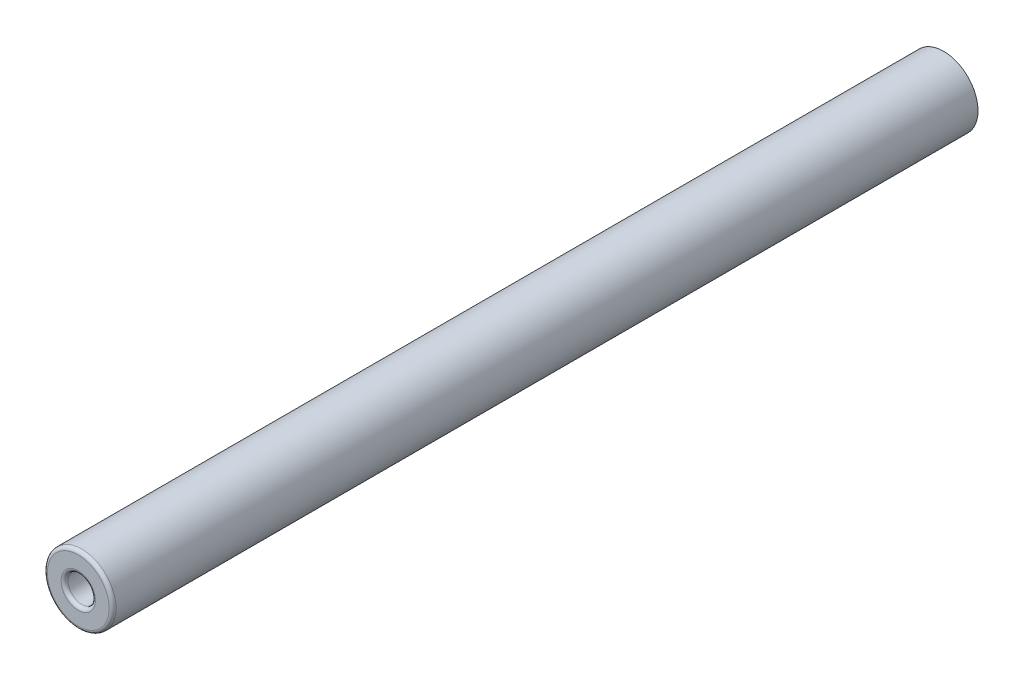
ISO-10303-21;
HEADER;
FILE_DESCRIPTION(('STEP AP214'),'2;1');
FILE_NAME('part.step','',(''),(''),'','','');
FILE_SCHEMA(('AUTOMOTIVE_DESIGN { 1 0 10303 214 1 1 1 1 }'));
ENDSEC;
DATA;
#1=APPLICATION_CONTEXT('core data for automotive mechanical design processes');
#2=APPLICATION_PROTOCOL_DEFINITION('international standard','automotive_design',2000,#1);
#3=PRODUCT_CONTEXT('',#1,'mechanical');
#4=PRODUCT('Part','Part','',(#3));
#5=PRODUCT_RELATED_PRODUCT_CATEGORY('part','',(#4));
#6=PRODUCT_DEFINITION_FORMATION('','',#4);
#7=PRODUCT_DEFINITION_CONTEXT('part definition',#1,'design');
#8=PRODUCT_DEFINITION('design','',#6,#7);
#9=PRODUCT_DEFINITION_SHAPE('','',#8);
#10=(LENGTH_UNIT() NAMED_UNIT(*) SI_UNIT(.MILLI.,.METRE.));
#11=(NAMED_UNIT(*) PLANE_ANGLE_UNIT() SI_UNIT($,.RADIAN.));
#12=(NAMED_UNIT(*) SI_UNIT($,.STERADIAN.) SOLID_ANGLE_UNIT());
#13=UNCERTAINTY_MEASURE_WITH_UNIT(LENGTH_MEASURE(1.E-05),#10,'distance_accuracy_value','');
#14=(GEOMETRIC_REPRESENTATION_CONTEXT(3) GLOBAL_UNCERTAINTY_ASSIGNED_CONTEXT((#13)) GLOBAL_UNIT_ASSIGNED_CONTEXT((#10,
#11,#12)) REPRESENTATION_CONTEXT('',''));
#15=CARTESIAN_POINT('',(0.,0.,0.));
#16=DIRECTION('',(0.,0.,1.));
#17=DIRECTION('',(1.,0.,0.));
#18=AXIS2_PLACEMENT_3D('',#15,#16,#17);
#19=CARTESIAN_POINT('',(0.,0.,63.));
#20=DIRECTION('',(0.,0.,-1.));
#21=DIRECTION('',(-1.,0.,0.));
#22=AXIS2_PLACEMENT_3D('',#19,#20,#21);
#23=CYLINDRICAL_SURFACE('',#22,2.5);
#24=CARTESIAN_POINT('',(0.,0.,62.75));
#25=DIRECTION('',(0.,0.,1.));
#26=DIRECTION('',(1.,0.,0.));
#27=AXIS2_PLACEMENT_3D('',#24,#25,#26);
#28=CIRCLE('',#27,2.5);
#29=CARTESIAN_POINT('',(2.5,0.,62.75));
#30=VERTEX_POINT('',#29);
#31=EDGE_CURVE('E45',#30,#30,#28,.F.);
#32=ORIENTED_EDGE('',*,*,#31,.T.);
#33=EDGE_LOOP('',(#32));
#34=FACE_BOUND('',#33,.T.);
#35=CARTESIAN_POINT('',(0.,0.,0.));
#36=DIRECTION('',(0.,0.,1.));
#37=DIRECTION('',(1.,0.,0.));
#38=AXIS2_PLACEMENT_3D('',#35,#36,#37);
#39=CIRCLE('',#38,2.5);
#40=CARTESIAN_POINT('',(2.5,0.,0.));
#41=VERTEX_POINT('',#40);
#42=EDGE_CURVE('E61',#41,#41,#39,.T.);
#43=ORIENTED_EDGE('',*,*,#42,.T.);
#44=EDGE_LOOP('',(#43));
#45=FACE_BOUND('',#44,.T.);
#46=ADVANCED_FACE('F37',(#34,#45),#23,.T.);
#47=CARTESIAN_POINT('',(0.,0.,63.));
#48=DIRECTION('',(0.,0.,1.));
#49=DIRECTION('',(1.,0.,0.));
#50=AXIS2_PLACEMENT_3D('',#47,#48,#49);
#51=PLANE('',#50);
#52=CARTESIAN_POINT('',(0.,0.,63.));
#53=DIRECTION('',(0.,0.,1.));
#54=DIRECTION('',(1.,0.,0.));
#55=AXIS2_PLACEMENT_3D('',#52,#53,#54);
#56=CIRCLE('',#55,2.25);
#57=CARTESIAN_POINT('',(2.25,0.,63.));
#58=VERTEX_POINT('',#57);
#59=EDGE_CURVE('E50',#58,#58,#56,.T.);
#60=ORIENTED_EDGE('',*,*,#59,.T.);
#61=EDGE_LOOP('',(#60));
#62=FACE_BOUND('',#61,.T.);
#63=CARTESIAN_POINT('',(0.,0.,63.));
#64=DIRECTION('',(0.,0.,1.));
#65=DIRECTION('',(1.,0.,0.));
#66=AXIS2_PLACEMENT_3D('',#63,#64,#65);
#67=CIRCLE('',#66,1.25);
#68=CARTESIAN_POINT('',(1.25,0.,63.));
#69=VERTEX_POINT('',#68);
#70=EDGE_CURVE('E55',#69,#69,#67,.F.);
#71=ORIENTED_EDGE('',*,*,#70,.T.);
#72=EDGE_LOOP('',(#71));
#73=FACE_BOUND('',#72,.T.);
#74=ADVANCED_FACE('F82',(#62,#73),#51,.T.);
#75=CARTESIAN_POINT('',(0.,0.,0.));
#76=DIRECTION('',(0.,0.,1.));
#77=DIRECTION('',(1.,0.,0.));
#78=AXIS2_PLACEMENT_3D('',#75,#76,#77);
#79=PLANE('',#78);
#80=ORIENTED_EDGE('',*,*,#42,.F.);
#81=EDGE_LOOP('',(#80));
#82=FACE_BOUND('',#81,.T.);
#83=ADVANCED_FACE('F74',(#82),#79,.F.);
#84=CARTESIAN_POINT('',(0.,0.,53.));
#85=DIRECTION('',(0.,0.,1.));
#86=DIRECTION('',(1.,0.,0.));
#87=AXIS2_PLACEMENT_3D('',#84,#85,#86);
#88=CYLINDRICAL_SURFACE('',#87,1.);
#89=CARTESIAN_POINT('',(0.,0.,62.75));
#90=DIRECTION('',(0.,0.,1.));
#91=DIRECTION('',(1.,0.,0.));
#92=AXIS2_PLACEMENT_3D('',#89,#90,#91);
#93=CIRCLE('',#92,1.);
#94=CARTESIAN_POINT('',(1.,0.,62.75));
#95=VERTEX_POINT('',#94);
#96=EDGE_CURVE('E10',#95,#95,#93,.T.);
#97=ORIENTED_EDGE('',*,*,#96,.T.);
#98=EDGE_LOOP('',(#97));
#99=FACE_BOUND('',#98,.T.);
#100=CARTESIAN_POINT('',(0.,0.,53.));
#101=DIRECTION('',(0.,0.,1.));
#102=DIRECTION('',(1.,0.,0.));
#103=AXIS2_PLACEMENT_3D('',#100,#101,#102);
#104=CIRCLE('',#103,1.);
#105=CARTESIAN_POINT('',(1.,0.,53.));
#106=VERTEX_POINT('',#105);
#107=EDGE_CURVE('E65',#106,#106,#104,.T.);
#108=ORIENTED_EDGE('',*,*,#107,.F.);
#109=EDGE_LOOP('',(#108));
#110=FACE_BOUND('',#109,.T.);
#111=ADVANCED_FACE('F72',(#99,#110),#88,.F.);
#112=CARTESIAN_POINT('',(0.,0.,53.));
#113=DIRECTION('',(0.,0.,1.));
#114=DIRECTION('',(1.,0.,0.));
#115=AXIS2_PLACEMENT_3D('',#112,#113,#114);
#116=PLANE('',#115);
#117=ORIENTED_EDGE('',*,*,#107,.T.);
#118=EDGE_LOOP('',(#117));
#119=FACE_BOUND('',#118,.T.);
#120=ADVANCED_FACE('F70',(#119),#116,.T.);
#121=CARTESIAN_POINT('',(0.,0.,62.75));
#122=DIRECTION('',(0.,0.,1.));
#123=DIRECTION('',(1.,0.,0.));
#124=AXIS2_PLACEMENT_3D('',#121,#122,#123);
#125=TOROIDAL_SURFACE('',#124,2.25,0.25);
#126=ORIENTED_EDGE('',*,*,#31,.F.);
#127=EDGE_LOOP('',(#126));
#128=FACE_BOUND('',#127,.T.);
#129=ORIENTED_EDGE('',*,*,#59,.F.);
#130=EDGE_LOOP('',(#129));
#131=FACE_BOUND('',#130,.T.);
#132=ADVANCED_FACE('F80',(#128,#131),#125,.T.);
#133=CARTESIAN_POINT('',(0.,0.,62.75));
#134=DIRECTION('',(0.,0.,1.));
#135=DIRECTION('',(1.,0.,0.));
#136=AXIS2_PLACEMENT_3D('',#133,#134,#135);
#137=TOROIDAL_SURFACE('',#136,1.25,0.25);
#138=ORIENTED_EDGE('',*,*,#70,.F.);
#139=EDGE_LOOP('',(#138));
#140=FACE_BOUND('',#139,.T.);
#141=ORIENTED_EDGE('',*,*,#96,.F.);
#142=EDGE_LOOP('',(#141));
#143=FACE_BOUND('',#142,.T.);
#144=ADVANCED_FACE('F39',(#140,#143),#137,.T.);
#145=CLOSED_SHELL('',(#46,#74,#83,#111,#120,#132,#144));
#146=MANIFOLD_SOLID_BREP('B2',#145);
#147=ADVANCED_BREP_SHAPE_REPRESENTATION('',(#18,#146),#14);
#148=SHAPE_DEFINITION_REPRESENTATION(#9,#147);
ENDSEC;
END-ISO-10303-21;
